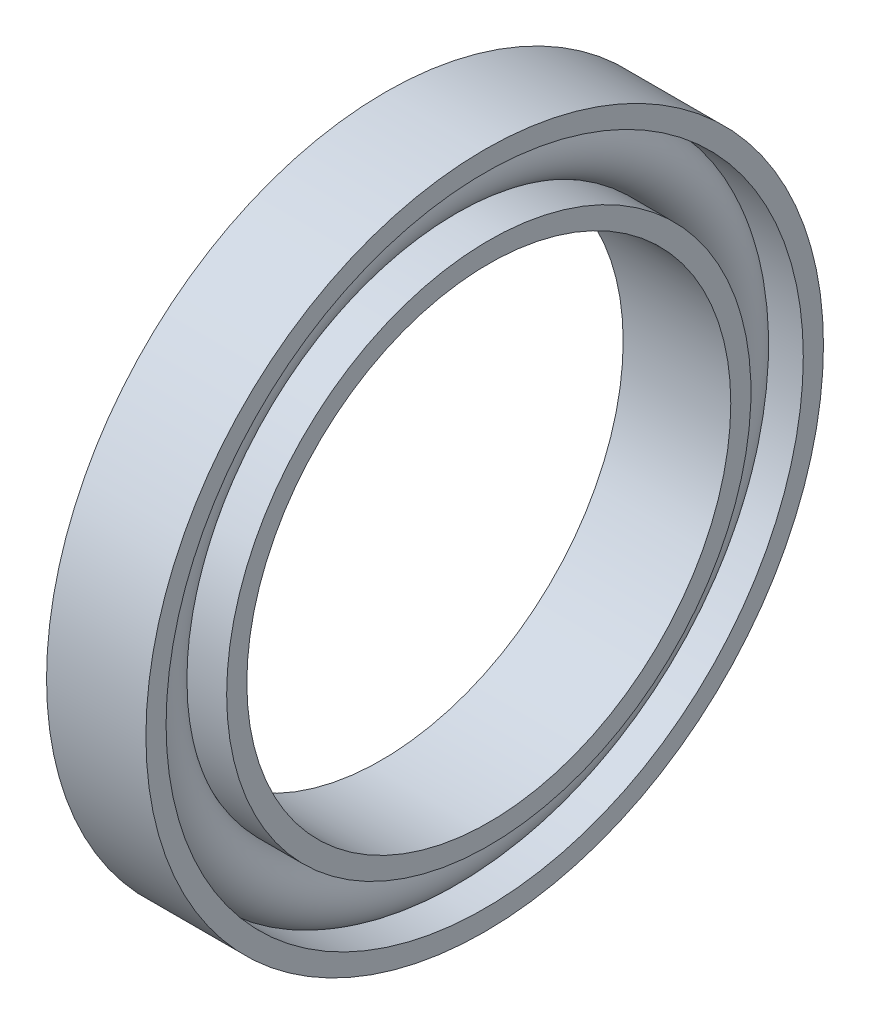
ISO-10303-21;
HEADER;
FILE_DESCRIPTION(('STEP AP214'),'2;1');
FILE_NAME('part.step','',(''),(''),'','','');
FILE_SCHEMA(('AUTOMOTIVE_DESIGN { 1 0 10303 214 1 1 1 1 }'));
ENDSEC;
DATA;
#1=APPLICATION_CONTEXT('core data for automotive mechanical design processes');
#2=APPLICATION_PROTOCOL_DEFINITION('international standard','automotive_design',2000,#1);
#3=PRODUCT_CONTEXT('',#1,'mechanical');
#4=PRODUCT('Part','Part','',(#3));
#5=PRODUCT_RELATED_PRODUCT_CATEGORY('part','',(#4));
#6=PRODUCT_DEFINITION_FORMATION('','',#4);
#7=PRODUCT_DEFINITION_CONTEXT('part definition',#1,'design');
#8=PRODUCT_DEFINITION('design','',#6,#7);
#9=PRODUCT_DEFINITION_SHAPE('','',#8);
#10=(LENGTH_UNIT() NAMED_UNIT(*) SI_UNIT(.MILLI.,.METRE.));
#11=(NAMED_UNIT(*) PLANE_ANGLE_UNIT() SI_UNIT($,.RADIAN.));
#12=(NAMED_UNIT(*) SI_UNIT($,.STERADIAN.) SOLID_ANGLE_UNIT());
#13=UNCERTAINTY_MEASURE_WITH_UNIT(LENGTH_MEASURE(1.E-05),#10,'distance_accuracy_value','');
#14=(GEOMETRIC_REPRESENTATION_CONTEXT(3) GLOBAL_UNCERTAINTY_ASSIGNED_CONTEXT((#13)) GLOBAL_UNIT_ASSIGNED_CONTEXT((#10,
#11,#12)) REPRESENTATION_CONTEXT('',''));
#15=CARTESIAN_POINT('',(0.,0.,0.));
#16=DIRECTION('',(0.,0.,1.));
#17=DIRECTION('',(1.,0.,0.));
#18=AXIS2_PLACEMENT_3D('',#15,#16,#17);
#19=CARTESIAN_POINT('',(0.,0.,0.));
#20=DIRECTION('',(1.,0.,0.));
#21=DIRECTION('',(0.,1.,0.));
#22=AXIS2_PLACEMENT_3D('',#19,#20,#21);
#23=CYLINDRICAL_SURFACE('',#22,19.);
#24=CARTESIAN_POINT('',(0.154999999999995,0.,0.));
#25=DIRECTION('',(1.,0.,0.));
#26=DIRECTION('',(0.,1.,0.));
#27=AXIS2_PLACEMENT_3D('',#24,#25,#26);
#28=CIRCLE('',#27,19.);
#29=CARTESIAN_POINT('',(0.154999999999995,19.,0.));
#30=VERTEX_POINT('',#29);
#31=EDGE_CURVE('E10',#30,#30,#28,.T.);
#32=ORIENTED_EDGE('',*,*,#31,.T.);
#33=EDGE_LOOP('',(#32));
#34=FACE_BOUND('',#33,.T.);
#35=CARTESIAN_POINT('',(1.47600997509336,0.,0.));
#36=DIRECTION('',(1.,0.,0.));
#37=DIRECTION('',(0.,1.,0.));
#38=AXIS2_PLACEMENT_3D('',#35,#36,#37);
#39=CIRCLE('',#38,19.);
#40=CARTESIAN_POINT('',(1.47600997509336,19.,0.));
#41=VERTEX_POINT('',#40);
#42=EDGE_CURVE('E30',#41,#41,#39,.T.);
#43=ORIENTED_EDGE('',*,*,#42,.F.);
#44=EDGE_LOOP('',(#43));
#45=FACE_BOUND('',#44,.T.);
#46=ADVANCED_FACE('F14',(#34,#45),#23,.T.);
#47=CARTESIAN_POINT('',(0.,0.,0.));
#48=DIRECTION('',(1.,0.,0.));
#49=DIRECTION('',(0.,1.,0.));
#50=AXIS2_PLACEMENT_3D('',#47,#48,#49);
#51=CYLINDRICAL_SURFACE('',#50,16.5);
#52=CARTESIAN_POINT('',(0.154999999999995,0.,0.));
#53=DIRECTION('',(1.,0.,0.));
#54=DIRECTION('',(0.,1.,0.));
#55=AXIS2_PLACEMENT_3D('',#52,#53,#54);
#56=CIRCLE('',#55,16.5);
#57=CARTESIAN_POINT('',(0.154999999999995,16.5,0.));
#58=VERTEX_POINT('',#57);
#59=EDGE_CURVE('E35',#58,#58,#56,.T.);
#60=ORIENTED_EDGE('',*,*,#59,.F.);
#61=EDGE_LOOP('',(#60));
#62=FACE_BOUND('',#61,.T.);
#63=CARTESIAN_POINT('',(1.9947424268866,0.,0.));
#64=DIRECTION('',(-1.,0.,0.));
#65=DIRECTION('',(0.,0.,1.));
#66=AXIS2_PLACEMENT_3D('',#63,#64,#65);
#67=CIRCLE('',#66,16.5);
#68=CARTESIAN_POINT('',(1.9947424268866,0.,16.5));
#69=VERTEX_POINT('',#68);
#70=EDGE_CURVE('E34',#69,#69,#67,.T.);
#71=ORIENTED_EDGE('',*,*,#70,.F.);
#72=EDGE_LOOP('',(#71));
#73=FACE_BOUND('',#72,.T.);
#74=ADVANCED_FACE('F96',(#62,#73),#51,.F.);
#75=CARTESIAN_POINT('',(0.,0.,0.));
#76=DIRECTION('',(-1.,0.,0.));
#77=DIRECTION('',(0.,0.,1.));
#78=AXIS2_PLACEMENT_3D('',#75,#76,#77);
#79=CYLINDRICAL_SURFACE('',#78,15.);
#80=CARTESIAN_POINT('',(6.415,0.,0.));
#81=DIRECTION('',(-1.,0.,0.));
#82=DIRECTION('',(0.,0.,1.));
#83=AXIS2_PLACEMENT_3D('',#80,#81,#82);
#84=CIRCLE('',#83,15.);
#85=CARTESIAN_POINT('',(6.415,0.,15.));
#86=VERTEX_POINT('',#85);
#87=EDGE_CURVE('E42',#86,#86,#84,.T.);
#88=ORIENTED_EDGE('',*,*,#87,.F.);
#89=EDGE_LOOP('',(#88));
#90=FACE_BOUND('',#89,.T.);
#91=CARTESIAN_POINT('',(-0.254999999999995,0.,0.));
#92=DIRECTION('',(-1.,0.,0.));
#93=DIRECTION('',(0.,0.,1.));
#94=AXIS2_PLACEMENT_3D('',#91,#92,#93);
#95=CIRCLE('',#94,15.);
#96=CARTESIAN_POINT('',(-0.254999999999995,0.,15.));
#97=VERTEX_POINT('',#96);
#98=EDGE_CURVE('E22',#97,#97,#95,.T.);
#99=ORIENTED_EDGE('',*,*,#98,.T.);
#100=EDGE_LOOP('',(#99));
#101=FACE_BOUND('',#100,.T.);
#102=ADVANCED_FACE('F101',(#90,#101),#79,.F.);
#103=CARTESIAN_POINT('',(0.,0.,0.));
#104=DIRECTION('',(-1.,0.,0.));
#105=DIRECTION('',(0.,0.,1.));
#106=AXIS2_PLACEMENT_3D('',#103,#104,#105);
#107=CYLINDRICAL_SURFACE('',#106,16.25);
#108=CARTESIAN_POINT('',(6.415,0.,0.));
#109=DIRECTION('',(-1.,0.,0.));
#110=DIRECTION('',(0.,0.,1.));
#111=AXIS2_PLACEMENT_3D('',#108,#109,#110);
#112=CIRCLE('',#111,16.25);
#113=CARTESIAN_POINT('',(6.415,0.,16.25));
#114=VERTEX_POINT('',#113);
#115=EDGE_CURVE('E27',#114,#114,#112,.T.);
#116=ORIENTED_EDGE('',*,*,#115,.T.);
#117=EDGE_LOOP('',(#116));
#118=FACE_BOUND('',#117,.T.);
#119=CARTESIAN_POINT('',(3.67227020860415,0.,0.));
#120=DIRECTION('',(1.,0.,0.));
#121=DIRECTION('',(0.,1.,0.));
#122=AXIS2_PLACEMENT_3D('',#119,#120,#121);
#123=CIRCLE('',#122,16.25);
#124=CARTESIAN_POINT('',(3.67227020860415,16.25,0.));
#125=VERTEX_POINT('',#124);
#126=EDGE_CURVE('E48',#125,#125,#123,.T.);
#127=ORIENTED_EDGE('',*,*,#126,.T.);
#128=EDGE_LOOP('',(#127));
#129=FACE_BOUND('',#128,.T.);
#130=ADVANCED_FACE('F107',(#118,#129),#107,.T.);
#131=CARTESIAN_POINT('',(0.,0.,0.));
#132=DIRECTION('',(-1.,0.,0.));
#133=DIRECTION('',(0.,0.,1.));
#134=AXIS2_PLACEMENT_3D('',#131,#132,#133);
#135=CYLINDRICAL_SURFACE('',#134,16.25);
#136=CARTESIAN_POINT('',(2.48772979139585,0.,0.));
#137=DIRECTION('',(-1.,0.,0.));
#138=DIRECTION('',(0.,0.,1.));
#139=AXIS2_PLACEMENT_3D('',#136,#137,#138);
#140=CIRCLE('',#139,16.25);
#141=CARTESIAN_POINT('',(2.48772979139585,0.,16.25));
#142=VERTEX_POINT('',#141);
#143=EDGE_CURVE('E51',#142,#142,#140,.T.);
#144=ORIENTED_EDGE('',*,*,#143,.T.);
#145=EDGE_LOOP('',(#144));
#146=FACE_BOUND('',#145,.T.);
#147=CARTESIAN_POINT('',(-0.254999999999995,0.,0.));
#148=DIRECTION('',(-1.,0.,0.));
#149=DIRECTION('',(0.,0.,1.));
#150=AXIS2_PLACEMENT_3D('',#147,#148,#149);
#151=CIRCLE('',#150,16.25);
#152=CARTESIAN_POINT('',(-0.254999999999995,0.,16.25));
#153=VERTEX_POINT('',#152);
#154=EDGE_CURVE('E38',#153,#153,#151,.T.);
#155=ORIENTED_EDGE('',*,*,#154,.F.);
#156=EDGE_LOOP('',(#155));
#157=FACE_BOUND('',#156,.T.);
#158=ADVANCED_FACE('F109',(#146,#157),#135,.T.);
#159=CARTESIAN_POINT('',(0.,0.,0.));
#160=DIRECTION('',(-1.,0.,0.));
#161=DIRECTION('',(0.,0.,1.));
#162=AXIS2_PLACEMENT_3D('',#159,#160,#161);
#163=CYLINDRICAL_SURFACE('',#162,21.);
#164=CARTESIAN_POINT('',(6.16,0.,0.));
#165=DIRECTION('',(-1.,0.,0.));
#166=DIRECTION('',(0.,0.,1.));
#167=AXIS2_PLACEMENT_3D('',#164,#165,#166);
#168=CIRCLE('',#167,21.);
#169=CARTESIAN_POINT('',(6.16,0.,21.));
#170=VERTEX_POINT('',#169);
#171=EDGE_CURVE('E54',#170,#170,#168,.T.);
#172=ORIENTED_EDGE('',*,*,#171,.T.);
#173=EDGE_LOOP('',(#172));
#174=FACE_BOUND('',#173,.T.);
#175=CARTESIAN_POINT('',(0.,0.,0.));
#176=DIRECTION('',(-1.,0.,0.));
#177=DIRECTION('',(0.,0.,1.));
#178=AXIS2_PLACEMENT_3D('',#175,#176,#177);
#179=CIRCLE('',#178,21.);
#180=CARTESIAN_POINT('',(0.,0.,21.));
#181=VERTEX_POINT('',#180);
#182=EDGE_CURVE('E41',#181,#181,#179,.T.);
#183=ORIENTED_EDGE('',*,*,#182,.F.);
#184=EDGE_LOOP('',(#183));
#185=FACE_BOUND('',#184,.T.);
#186=ADVANCED_FACE('F112',(#174,#185),#163,.T.);
#187=CARTESIAN_POINT('',(0.,0.,0.));
#188=DIRECTION('',(-1.,0.,0.));
#189=DIRECTION('',(0.,0.,1.));
#190=AXIS2_PLACEMENT_3D('',#187,#188,#189);
#191=CYLINDRICAL_SURFACE('',#190,19.75);
#192=CARTESIAN_POINT('',(6.16,0.,0.));
#193=DIRECTION('',(-1.,0.,0.));
#194=DIRECTION('',(0.,0.,1.));
#195=AXIS2_PLACEMENT_3D('',#192,#193,#194);
#196=CIRCLE('',#195,19.75);
#197=CARTESIAN_POINT('',(6.16,0.,19.75));
#198=VERTEX_POINT('',#197);
#199=EDGE_CURVE('E44',#198,#198,#196,.T.);
#200=ORIENTED_EDGE('',*,*,#199,.F.);
#201=EDGE_LOOP('',(#200));
#202=FACE_BOUND('',#201,.T.);
#203=CARTESIAN_POINT('',(3.82416664800299,0.,0.));
#204=DIRECTION('',(1.,0.,0.));
#205=DIRECTION('',(0.,1.,0.));
#206=AXIS2_PLACEMENT_3D('',#203,#204,#205);
#207=CIRCLE('',#206,19.75);
#208=CARTESIAN_POINT('',(3.82416664800299,19.75,0.));
#209=VERTEX_POINT('',#208);
#210=EDGE_CURVE('E63',#209,#209,#207,.T.);
#211=ORIENTED_EDGE('',*,*,#210,.F.);
#212=EDGE_LOOP('',(#211));
#213=FACE_BOUND('',#212,.T.);
#214=ADVANCED_FACE('F16',(#202,#213),#191,.F.);
#215=CARTESIAN_POINT('',(0.,0.,0.));
#216=DIRECTION('',(-1.,0.,0.));
#217=DIRECTION('',(0.,0.,1.));
#218=AXIS2_PLACEMENT_3D('',#215,#216,#217);
#219=CYLINDRICAL_SURFACE('',#218,19.75);
#220=CARTESIAN_POINT('',(2.33583335199701,0.,0.));
#221=DIRECTION('',(-1.,0.,0.));
#222=DIRECTION('',(0.,0.,1.));
#223=AXIS2_PLACEMENT_3D('',#220,#221,#222);
#224=CIRCLE('',#223,19.75);
#225=CARTESIAN_POINT('',(2.33583335199701,0.,19.75));
#226=VERTEX_POINT('',#225);
#227=EDGE_CURVE('E33',#226,#226,#224,.T.);
#228=ORIENTED_EDGE('',*,*,#227,.F.);
#229=EDGE_LOOP('',(#228));
#230=FACE_BOUND('',#229,.T.);
#231=CARTESIAN_POINT('',(0.,0.,0.));
#232=DIRECTION('',(-1.,0.,0.));
#233=DIRECTION('',(0.,0.,1.));
#234=AXIS2_PLACEMENT_3D('',#231,#232,#233);
#235=CIRCLE('',#234,19.75);
#236=CARTESIAN_POINT('',(0.,0.,19.75));
#237=VERTEX_POINT('',#236);
#238=EDGE_CURVE('E18',#237,#237,#235,.T.);
#239=ORIENTED_EDGE('',*,*,#238,.T.);
#240=EDGE_LOOP('',(#239));
#241=FACE_BOUND('',#240,.T.);
#242=ADVANCED_FACE('F71',(#230,#241),#219,.F.);
#243=CARTESIAN_POINT('',(3.08,0.,0.));
#244=DIRECTION('',(-1.,0.,0.));
#245=DIRECTION('',(0.,0.,1.));
#246=AXIS2_PLACEMENT_3D('',#243,#244,#245);
#247=TOROIDAL_SURFACE('',#246,18.029,1.875);
#248=ORIENTED_EDGE('',*,*,#126,.F.);
#249=EDGE_LOOP('',(#248));
#250=FACE_BOUND('',#249,.T.);
#251=ORIENTED_EDGE('',*,*,#210,.T.);
#252=EDGE_LOOP('',(#251));
#253=FACE_BOUND('',#252,.T.);
#254=ADVANCED_FACE('F74',(#250,#253),#247,.T.);
#255=CARTESIAN_POINT('',(3.08,0.,0.));
#256=DIRECTION('',(-1.,0.,0.));
#257=DIRECTION('',(0.,0.,1.));
#258=AXIS2_PLACEMENT_3D('',#255,#256,#257);
#259=TOROIDAL_SURFACE('',#258,18.029,1.875);
#260=ORIENTED_EDGE('',*,*,#227,.T.);
#261=EDGE_LOOP('',(#260));
#262=FACE_BOUND('',#261,.T.);
#263=ORIENTED_EDGE('',*,*,#42,.T.);
#264=EDGE_LOOP('',(#263));
#265=FACE_BOUND('',#264,.T.);
#266=ADVANCED_FACE('F68',(#262,#265),#259,.T.);
#267=CARTESIAN_POINT('',(3.08,0.,0.));
#268=DIRECTION('',(-1.,0.,0.));
#269=DIRECTION('',(0.,0.,1.));
#270=AXIS2_PLACEMENT_3D('',#267,#268,#269);
#271=TOROIDAL_SURFACE('',#270,18.029,1.875);
#272=ORIENTED_EDGE('',*,*,#70,.T.);
#273=EDGE_LOOP('',(#272));
#274=FACE_BOUND('',#273,.T.);
#275=ORIENTED_EDGE('',*,*,#143,.F.);
#276=EDGE_LOOP('',(#275));
#277=FACE_BOUND('',#276,.T.);
#278=ADVANCED_FACE('F82',(#274,#277),#271,.T.);
#279=CARTESIAN_POINT('',(0.,19.75,0.));
#280=DIRECTION('',(1.,0.,0.));
#281=DIRECTION('',(0.,0.,-1.));
#282=AXIS2_PLACEMENT_3D('',#279,#280,#281);
#283=PLANE('',#282);
#284=ORIENTED_EDGE('',*,*,#182,.T.);
#285=EDGE_LOOP('',(#284));
#286=FACE_BOUND('',#285,.T.);
#287=ORIENTED_EDGE('',*,*,#238,.F.);
#288=EDGE_LOOP('',(#287));
#289=FACE_BOUND('',#288,.T.);
#290=ADVANCED_FACE('F79',(#286,#289),#283,.F.);
#291=CARTESIAN_POINT('',(6.16,21.,0.));
#292=DIRECTION('',(-1.,0.,0.));
#293=DIRECTION('',(0.,0.,1.));
#294=AXIS2_PLACEMENT_3D('',#291,#292,#293);
#295=PLANE('',#294);
#296=ORIENTED_EDGE('',*,*,#171,.F.);
#297=EDGE_LOOP('',(#296));
#298=FACE_BOUND('',#297,.T.);
#299=ORIENTED_EDGE('',*,*,#199,.T.);
#300=EDGE_LOOP('',(#299));
#301=FACE_BOUND('',#300,.T.);
#302=ADVANCED_FACE('F81',(#298,#301),#295,.F.);
#303=CARTESIAN_POINT('',(6.415,15.,0.));
#304=DIRECTION('',(-1.,0.,0.));
#305=DIRECTION('',(0.,0.,1.));
#306=AXIS2_PLACEMENT_3D('',#303,#304,#305);
#307=PLANE('',#306);
#308=ORIENTED_EDGE('',*,*,#115,.F.);
#309=EDGE_LOOP('',(#308));
#310=FACE_BOUND('',#309,.T.);
#311=ORIENTED_EDGE('',*,*,#87,.T.);
#312=EDGE_LOOP('',(#311));
#313=FACE_BOUND('',#312,.T.);
#314=ADVANCED_FACE('F90',(#310,#313),#307,.F.);
#315=CARTESIAN_POINT('',(-0.254999999999995,15.,0.));
#316=DIRECTION('',(1.,0.,0.));
#317=DIRECTION('',(0.,0.,-1.));
#318=AXIS2_PLACEMENT_3D('',#315,#316,#317);
#319=PLANE('',#318);
#320=ORIENTED_EDGE('',*,*,#154,.T.);
#321=EDGE_LOOP('',(#320));
#322=FACE_BOUND('',#321,.T.);
#323=ORIENTED_EDGE('',*,*,#98,.F.);
#324=EDGE_LOOP('',(#323));
#325=FACE_BOUND('',#324,.T.);
#326=ADVANCED_FACE('F126',(#322,#325),#319,.F.);
#327=CARTESIAN_POINT('',(0.154999999999995,19.,0.));
#328=DIRECTION('',(-1.,0.,0.));
#329=DIRECTION('',(0.,0.,1.));
#330=AXIS2_PLACEMENT_3D('',#327,#328,#329);
#331=PLANE('',#330);
#332=ORIENTED_EDGE('',*,*,#31,.F.);
#333=EDGE_LOOP('',(#332));
#334=FACE_BOUND('',#333,.T.);
#335=ORIENTED_EDGE('',*,*,#59,.T.);
#336=EDGE_LOOP('',(#335));
#337=FACE_BOUND('',#336,.T.);
#338=ADVANCED_FACE('F129',(#334,#337),#331,.T.);
#339=CLOSED_SHELL('',(#46,#74,#102,#130,#158,#186,#214,#242,#254,#266,#278,#290,#302,#314,#326,#338));
#340=MANIFOLD_SOLID_BREP('B1',#339);
#341=ADVANCED_BREP_SHAPE_REPRESENTATION('',(#18,#340),#14);
#342=SHAPE_DEFINITION_REPRESENTATION(#9,#341);
ENDSEC;
END-ISO-10303-21;
